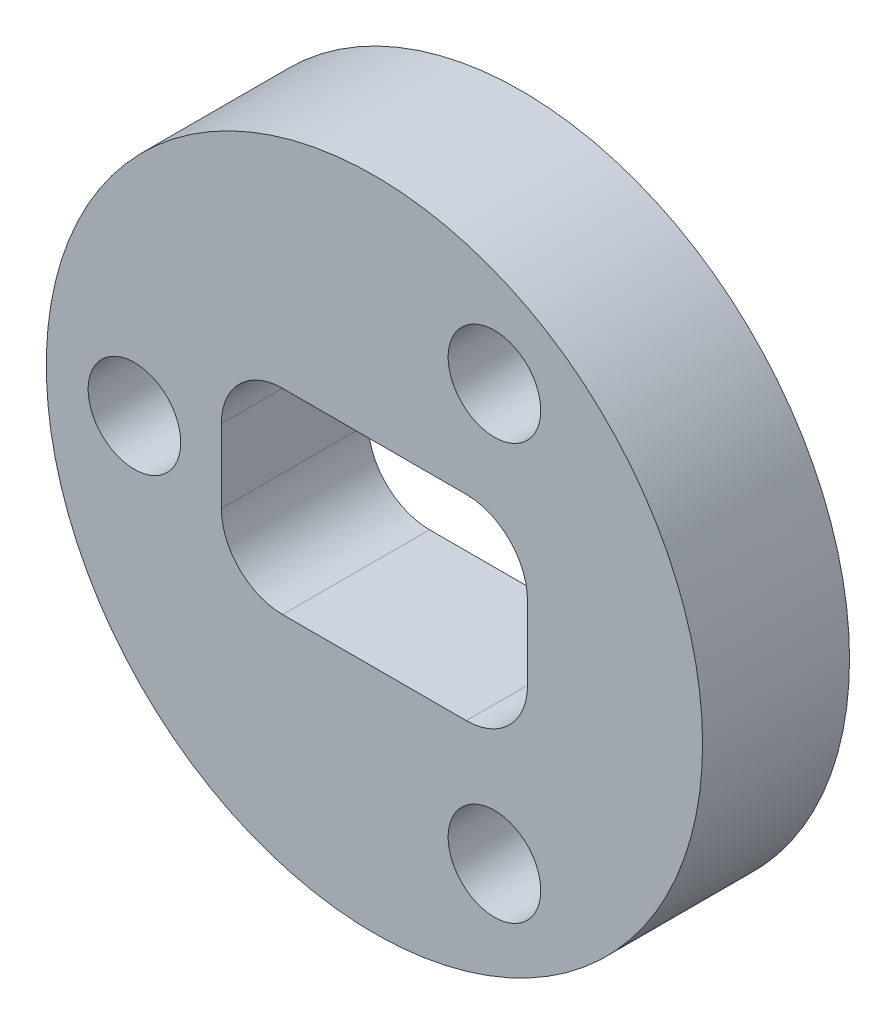
ISO-10303-21;
HEADER;
FILE_DESCRIPTION(('STEP AP214'),'2;1');
FILE_NAME('part.step','',(''),(''),'','','');
FILE_SCHEMA(('AUTOMOTIVE_DESIGN { 1 0 10303 214 1 1 1 1 }'));
ENDSEC;
DATA;
#1=APPLICATION_CONTEXT('core data for automotive mechanical design processes');
#2=APPLICATION_PROTOCOL_DEFINITION('international standard','automotive_design',2000,#1);
#3=PRODUCT_CONTEXT('',#1,'mechanical');
#4=PRODUCT('Part','Part','',(#3));
#5=PRODUCT_RELATED_PRODUCT_CATEGORY('part','',(#4));
#6=PRODUCT_DEFINITION_FORMATION('','',#4);
#7=PRODUCT_DEFINITION_CONTEXT('part definition',#1,'design');
#8=PRODUCT_DEFINITION('design','',#6,#7);
#9=PRODUCT_DEFINITION_SHAPE('','',#8);
#10=(LENGTH_UNIT() NAMED_UNIT(*) SI_UNIT(.MILLI.,.METRE.));
#11=(NAMED_UNIT(*) PLANE_ANGLE_UNIT() SI_UNIT($,.RADIAN.));
#12=(NAMED_UNIT(*) SI_UNIT($,.STERADIAN.) SOLID_ANGLE_UNIT());
#13=UNCERTAINTY_MEASURE_WITH_UNIT(LENGTH_MEASURE(1.E-05),#10,'distance_accuracy_value','');
#14=(GEOMETRIC_REPRESENTATION_CONTEXT(3) GLOBAL_UNCERTAINTY_ASSIGNED_CONTEXT((#13)) GLOBAL_UNIT_ASSIGNED_CONTEXT((#10,
#11,#12)) REPRESENTATION_CONTEXT('',''));
#15=CARTESIAN_POINT('',(0.,0.,0.));
#16=DIRECTION('',(0.,0.,1.));
#17=DIRECTION('',(1.,0.,0.));
#18=AXIS2_PLACEMENT_3D('',#15,#16,#17);
#19=CARTESIAN_POINT('',(0.,0.,3.81));
#20=DIRECTION('',(0.,0.,-1.));
#21=DIRECTION('',(-1.,0.,0.));
#22=AXIS2_PLACEMENT_3D('',#19,#20,#21);
#23=CYLINDRICAL_SURFACE('',#22,8.509);
#24=CARTESIAN_POINT('',(0.,0.,3.81));
#25=DIRECTION('',(0.,0.,1.));
#26=DIRECTION('',(1.,0.,0.));
#27=AXIS2_PLACEMENT_3D('',#24,#25,#26);
#28=CIRCLE('',#27,8.509);
#29=CARTESIAN_POINT('',(8.509,0.,3.81));
#30=VERTEX_POINT('',#29);
#31=EDGE_CURVE('E135',#30,#30,#28,.T.);
#32=ORIENTED_EDGE('',*,*,#31,.F.);
#33=EDGE_LOOP('',(#32));
#34=FACE_BOUND('',#33,.T.);
#35=CARTESIAN_POINT('',(0.,0.,0.));
#36=DIRECTION('',(0.,0.,1.));
#37=DIRECTION('',(1.,0.,0.));
#38=AXIS2_PLACEMENT_3D('',#35,#36,#37);
#39=CIRCLE('',#38,8.509);
#40=CARTESIAN_POINT('',(8.509,0.,0.));
#41=VERTEX_POINT('',#40);
#42=EDGE_CURVE('E138',#41,#41,#39,.T.);
#43=ORIENTED_EDGE('',*,*,#42,.T.);
#44=EDGE_LOOP('',(#43));
#45=FACE_BOUND('',#44,.T.);
#46=ADVANCED_FACE('F32',(#34,#45),#23,.T.);
#47=CARTESIAN_POINT('',(0.,0.,3.81));
#48=DIRECTION('',(0.,0.,1.));
#49=DIRECTION('',(1.,0.,0.));
#50=AXIS2_PLACEMENT_3D('',#47,#48,#49);
#51=PLANE('',#50);
#52=CARTESIAN_POINT('',(-6.223,0.,3.81));
#53=DIRECTION('',(0.,0.,1.));
#54=DIRECTION('',(1.,0.,0.));
#55=AXIS2_PLACEMENT_3D('',#52,#53,#54);
#56=CIRCLE('',#55,1.19999999999999);
#57=CARTESIAN_POINT('',(-5.02300000000001,0.,3.81));
#58=VERTEX_POINT('',#57);
#59=EDGE_CURVE('E200',#58,#58,#56,.T.);
#60=ORIENTED_EDGE('',*,*,#59,.F.);
#61=EDGE_LOOP('',(#60));
#62=FACE_BOUND('',#61,.T.);
#63=CARTESIAN_POINT('',(3.11150000000003,5.38927608775061,3.81));
#64=DIRECTION('',(0.,0.,1.));
#65=DIRECTION('',(1.,0.,0.));
#66=AXIS2_PLACEMENT_3D('',#63,#64,#65);
#67=CIRCLE('',#66,1.19999999999999);
#68=CARTESIAN_POINT('',(4.31150000000002,5.38927608775061,3.81));
#69=VERTEX_POINT('',#68);
#70=EDGE_CURVE('E192',#69,#69,#67,.T.);
#71=ORIENTED_EDGE('',*,*,#70,.F.);
#72=EDGE_LOOP('',(#71));
#73=FACE_BOUND('',#72,.T.);
#74=CARTESIAN_POINT('',(3.11150000000005,-5.38927608775056,3.81));
#75=DIRECTION('',(0.,0.,1.));
#76=DIRECTION('',(1.,0.,0.));
#77=AXIS2_PLACEMENT_3D('',#74,#75,#76);
#78=CIRCLE('',#77,1.19999999999999);
#79=CARTESIAN_POINT('',(4.31150000000004,-5.38927608775056,3.81));
#80=VERTEX_POINT('',#79);
#81=EDGE_CURVE('E184',#80,#80,#78,.T.);
#82=ORIENTED_EDGE('',*,*,#81,.F.);
#83=EDGE_LOOP('',(#82));
#84=FACE_BOUND('',#83,.T.);
#85=DIRECTION('',(0.,-1.,0.));
#86=VECTOR('',#85,1.);
#87=CARTESIAN_POINT('',(-3.96875,2.54,3.81));
#88=LINE('',#87,#86);
#89=CARTESIAN_POINT('',(-3.96875,0.9525,3.81));
#90=VERTEX_POINT('',#89);
#91=CARTESIAN_POINT('',(-3.96875,-0.952500000000001,3.81));
#92=VERTEX_POINT('',#91);
#93=EDGE_CURVE('E131',#90,#92,#88,.T.);
#94=ORIENTED_EDGE('',*,*,#93,.F.);
#95=CARTESIAN_POINT('',(-2.38125,0.9525,3.81));
#96=DIRECTION('',(0.,0.,1.));
#97=DIRECTION('',(1.,0.,0.));
#98=AXIS2_PLACEMENT_3D('',#95,#96,#97);
#99=CIRCLE('',#98,1.5875);
#100=CARTESIAN_POINT('',(-2.38125,2.54,3.81));
#101=VERTEX_POINT('',#100);
#102=EDGE_CURVE('E40',#90,#101,#99,.F.);
#103=ORIENTED_EDGE('',*,*,#102,.T.);
#104=DIRECTION('',(-1.,0.,0.));
#105=VECTOR('',#104,1.);
#106=CARTESIAN_POINT('',(-3.96875,2.54,3.81));
#107=LINE('',#106,#105);
#108=CARTESIAN_POINT('',(2.38125,2.54,3.81));
#109=VERTEX_POINT('',#108);
#110=EDGE_CURVE('E126',#109,#101,#107,.T.);
#111=ORIENTED_EDGE('',*,*,#110,.F.);
#112=CARTESIAN_POINT('',(2.38125,0.9525,3.81));
#113=DIRECTION('',(0.,0.,1.));
#114=DIRECTION('',(1.,0.,0.));
#115=AXIS2_PLACEMENT_3D('',#112,#113,#114);
#116=CIRCLE('',#115,1.5875);
#117=CARTESIAN_POINT('',(3.96875,0.9525,3.81));
#118=VERTEX_POINT('',#117);
#119=EDGE_CURVE('E125',#109,#118,#116,.F.);
#120=ORIENTED_EDGE('',*,*,#119,.T.);
#121=DIRECTION('',(0.,1.,0.));
#122=VECTOR('',#121,1.);
#123=CARTESIAN_POINT('',(3.96875,2.54,3.81));
#124=LINE('',#123,#122);
#125=CARTESIAN_POINT('',(3.96875,-0.952500000000002,3.81));
#126=VERTEX_POINT('',#125);
#127=EDGE_CURVE('E115',#126,#118,#124,.T.);
#128=ORIENTED_EDGE('',*,*,#127,.F.);
#129=CARTESIAN_POINT('',(2.38125,-0.952500000000001,3.81));
#130=DIRECTION('',(0.,0.,1.));
#131=DIRECTION('',(1.,0.,0.));
#132=AXIS2_PLACEMENT_3D('',#129,#130,#131);
#133=CIRCLE('',#132,1.5875);
#134=CARTESIAN_POINT('',(2.38125,-2.54,3.81));
#135=VERTEX_POINT('',#134);
#136=EDGE_CURVE('E98',#126,#135,#133,.F.);
#137=ORIENTED_EDGE('',*,*,#136,.T.);
#138=DIRECTION('',(1.,0.,0.));
#139=VECTOR('',#138,1.);
#140=CARTESIAN_POINT('',(-3.96875,-2.54,3.81));
#141=LINE('',#140,#139);
#142=CARTESIAN_POINT('',(-2.38125,-2.54,3.81));
#143=VERTEX_POINT('',#142);
#144=EDGE_CURVE('E127',#143,#135,#141,.T.);
#145=ORIENTED_EDGE('',*,*,#144,.F.);
#146=CARTESIAN_POINT('',(-2.38125,-0.952500000000001,3.81));
#147=DIRECTION('',(0.,0.,1.));
#148=DIRECTION('',(1.,0.,0.));
#149=AXIS2_PLACEMENT_3D('',#146,#147,#148);
#150=CIRCLE('',#149,1.5875);
#151=EDGE_CURVE('E155',#143,#92,#150,.F.);
#152=ORIENTED_EDGE('',*,*,#151,.T.);
#153=EDGE_LOOP('',(#94,#103,#111,#120,#128,#137,#145,#152));
#154=FACE_BOUND('',#153,.T.);
#155=ORIENTED_EDGE('',*,*,#31,.T.);
#156=EDGE_LOOP('',(#155));
#157=FACE_BOUND('',#156,.T.);
#158=ADVANCED_FACE('F122',(#62,#73,#84,#154,#157),#51,.T.);
#159=CARTESIAN_POINT('',(0.,0.,0.));
#160=DIRECTION('',(0.,0.,1.));
#161=DIRECTION('',(1.,0.,0.));
#162=AXIS2_PLACEMENT_3D('',#159,#160,#161);
#163=PLANE('',#162);
#164=CARTESIAN_POINT('',(-6.223,0.,0.));
#165=DIRECTION('',(0.,0.,1.));
#166=DIRECTION('',(1.,0.,0.));
#167=AXIS2_PLACEMENT_3D('',#164,#165,#166);
#168=CIRCLE('',#167,1.2);
#169=CARTESIAN_POINT('',(-5.023,0.,0.));
#170=VERTEX_POINT('',#169);
#171=EDGE_CURVE('E197',#170,#170,#168,.T.);
#172=ORIENTED_EDGE('',*,*,#171,.T.);
#173=EDGE_LOOP('',(#172));
#174=FACE_BOUND('',#173,.T.);
#175=CARTESIAN_POINT('',(3.11150000000003,5.38927608775061,0.));
#176=DIRECTION('',(0.,0.,1.));
#177=DIRECTION('',(1.,0.,0.));
#178=AXIS2_PLACEMENT_3D('',#175,#176,#177);
#179=CIRCLE('',#178,1.2);
#180=CARTESIAN_POINT('',(4.31150000000003,5.38927608775061,0.));
#181=VERTEX_POINT('',#180);
#182=EDGE_CURVE('E188',#181,#181,#179,.T.);
#183=ORIENTED_EDGE('',*,*,#182,.T.);
#184=EDGE_LOOP('',(#183));
#185=FACE_BOUND('',#184,.T.);
#186=CARTESIAN_POINT('',(3.11150000000005,-5.38927608775056,0.));
#187=DIRECTION('',(0.,0.,1.));
#188=DIRECTION('',(1.,0.,0.));
#189=AXIS2_PLACEMENT_3D('',#186,#187,#188);
#190=CIRCLE('',#189,1.2);
#191=CARTESIAN_POINT('',(4.31150000000005,-5.38927608775056,0.));
#192=VERTEX_POINT('',#191);
#193=EDGE_CURVE('E179',#192,#192,#190,.T.);
#194=ORIENTED_EDGE('',*,*,#193,.T.);
#195=EDGE_LOOP('',(#194));
#196=FACE_BOUND('',#195,.T.);
#197=DIRECTION('',(0.,1.,0.));
#198=VECTOR('',#197,1.);
#199=CARTESIAN_POINT('',(3.96875,2.54,0.));
#200=LINE('',#199,#198);
#201=CARTESIAN_POINT('',(3.96875,-0.952500000000002,0.));
#202=VERTEX_POINT('',#201);
#203=CARTESIAN_POINT('',(3.96875,0.9525,0.));
#204=VERTEX_POINT('',#203);
#205=EDGE_CURVE('E117',#202,#204,#200,.T.);
#206=ORIENTED_EDGE('',*,*,#205,.T.);
#207=CARTESIAN_POINT('',(2.38125,0.9525,0.));
#208=DIRECTION('',(0.,0.,1.));
#209=DIRECTION('',(1.,0.,0.));
#210=AXIS2_PLACEMENT_3D('',#207,#208,#209);
#211=CIRCLE('',#210,1.5875);
#212=CARTESIAN_POINT('',(2.38125,2.54,0.));
#213=VERTEX_POINT('',#212);
#214=EDGE_CURVE('E54',#204,#213,#211,.T.);
#215=ORIENTED_EDGE('',*,*,#214,.T.);
#216=DIRECTION('',(-1.,0.,0.));
#217=VECTOR('',#216,1.);
#218=CARTESIAN_POINT('',(-3.96875,2.54,0.));
#219=LINE('',#218,#217);
#220=CARTESIAN_POINT('',(-2.38125,2.54,0.));
#221=VERTEX_POINT('',#220);
#222=EDGE_CURVE('E141',#213,#221,#219,.T.);
#223=ORIENTED_EDGE('',*,*,#222,.T.);
#224=CARTESIAN_POINT('',(-2.38125,0.9525,0.));
#225=DIRECTION('',(0.,0.,1.));
#226=DIRECTION('',(1.,0.,0.));
#227=AXIS2_PLACEMENT_3D('',#224,#225,#226);
#228=CIRCLE('',#227,1.5875);
#229=CARTESIAN_POINT('',(-3.96875,0.9525,0.));
#230=VERTEX_POINT('',#229);
#231=EDGE_CURVE('E11',#221,#230,#228,.T.);
#232=ORIENTED_EDGE('',*,*,#231,.T.);
#233=DIRECTION('',(0.,-1.,0.));
#234=VECTOR('',#233,1.);
#235=CARTESIAN_POINT('',(-3.96875,2.54,0.));
#236=LINE('',#235,#234);
#237=CARTESIAN_POINT('',(-3.96875,-0.952500000000001,0.));
#238=VERTEX_POINT('',#237);
#239=EDGE_CURVE('E129',#230,#238,#236,.T.);
#240=ORIENTED_EDGE('',*,*,#239,.T.);
#241=CARTESIAN_POINT('',(-2.38125,-0.952500000000001,0.));
#242=DIRECTION('',(0.,0.,1.));
#243=DIRECTION('',(1.,0.,0.));
#244=AXIS2_PLACEMENT_3D('',#241,#242,#243);
#245=CIRCLE('',#244,1.5875);
#246=CARTESIAN_POINT('',(-2.38125,-2.54,0.));
#247=VERTEX_POINT('',#246);
#248=EDGE_CURVE('E157',#238,#247,#245,.T.);
#249=ORIENTED_EDGE('',*,*,#248,.T.);
#250=DIRECTION('',(1.,0.,0.));
#251=VECTOR('',#250,1.);
#252=CARTESIAN_POINT('',(-3.96875,-2.54,0.));
#253=LINE('',#252,#251);
#254=CARTESIAN_POINT('',(2.38125,-2.54,0.));
#255=VERTEX_POINT('',#254);
#256=EDGE_CURVE('E174',#247,#255,#253,.T.);
#257=ORIENTED_EDGE('',*,*,#256,.T.);
#258=CARTESIAN_POINT('',(2.38125,-0.952500000000001,0.));
#259=DIRECTION('',(0.,0.,1.));
#260=DIRECTION('',(1.,0.,0.));
#261=AXIS2_PLACEMENT_3D('',#258,#259,#260);
#262=CIRCLE('',#261,1.5875);
#263=EDGE_CURVE('E108',#255,#202,#262,.T.);
#264=ORIENTED_EDGE('',*,*,#263,.T.);
#265=EDGE_LOOP('',(#206,#215,#223,#232,#240,#249,#257,#264));
#266=FACE_BOUND('',#265,.T.);
#267=ORIENTED_EDGE('',*,*,#42,.F.);
#268=EDGE_LOOP('',(#267));
#269=FACE_BOUND('',#268,.T.);
#270=ADVANCED_FACE('F168',(#174,#185,#196,#266,#269),#163,.F.);
#271=CARTESIAN_POINT('',(-3.96875,2.54,0.));
#272=DIRECTION('',(-1.,0.,0.));
#273=DIRECTION('',(0.,-1.,0.));
#274=AXIS2_PLACEMENT_3D('',#271,#272,#273);
#275=PLANE('',#274);
#276=ORIENTED_EDGE('',*,*,#93,.T.);
#277=DIRECTION('',(0.,0.,1.));
#278=VECTOR('',#277,1.);
#279=CARTESIAN_POINT('',(-3.96875,-0.952500000000001,0.));
#280=LINE('',#279,#278);
#281=EDGE_CURVE('E149',#92,#238,#280,.F.);
#282=ORIENTED_EDGE('',*,*,#281,.T.);
#283=ORIENTED_EDGE('',*,*,#239,.F.);
#284=DIRECTION('',(0.,0.,1.));
#285=VECTOR('',#284,1.);
#286=CARTESIAN_POINT('',(-3.96875,0.9525,3.81));
#287=LINE('',#286,#285);
#288=EDGE_CURVE('E146',#230,#90,#287,.T.);
#289=ORIENTED_EDGE('',*,*,#288,.T.);
#290=EDGE_LOOP('',(#276,#282,#283,#289));
#291=FACE_BOUND('',#290,.T.);
#292=ADVANCED_FACE('F172',(#291),#275,.F.);
#293=CARTESIAN_POINT('',(-3.96875,2.54,0.));
#294=DIRECTION('',(0.,1.,0.));
#295=DIRECTION('',(0.,0.,1.));
#296=AXIS2_PLACEMENT_3D('',#293,#294,#295);
#297=PLANE('',#296);
#298=ORIENTED_EDGE('',*,*,#222,.F.);
#299=DIRECTION('',(0.,0.,1.));
#300=VECTOR('',#299,1.);
#301=CARTESIAN_POINT('',(2.38125,2.54,3.81));
#302=LINE('',#301,#300);
#303=EDGE_CURVE('E109',#213,#109,#302,.T.);
#304=ORIENTED_EDGE('',*,*,#303,.T.);
#305=ORIENTED_EDGE('',*,*,#110,.T.);
#306=DIRECTION('',(0.,0.,1.));
#307=VECTOR('',#306,1.);
#308=CARTESIAN_POINT('',(-2.38125,2.54,0.));
#309=LINE('',#308,#307);
#310=EDGE_CURVE('E47',#101,#221,#309,.F.);
#311=ORIENTED_EDGE('',*,*,#310,.T.);
#312=EDGE_LOOP('',(#298,#304,#305,#311));
#313=FACE_BOUND('',#312,.T.);
#314=ADVANCED_FACE('F163',(#313),#297,.F.);
#315=CARTESIAN_POINT('',(3.96875,2.54,0.));
#316=DIRECTION('',(1.,0.,0.));
#317=DIRECTION('',(0.,1.,0.));
#318=AXIS2_PLACEMENT_3D('',#315,#316,#317);
#319=PLANE('',#318);
#320=ORIENTED_EDGE('',*,*,#205,.F.);
#321=DIRECTION('',(0.,0.,1.));
#322=VECTOR('',#321,1.);
#323=CARTESIAN_POINT('',(3.96875,-0.952500000000001,3.81));
#324=LINE('',#323,#322);
#325=EDGE_CURVE('E102',#202,#126,#324,.T.);
#326=ORIENTED_EDGE('',*,*,#325,.T.);
#327=ORIENTED_EDGE('',*,*,#127,.T.);
#328=DIRECTION('',(0.,0.,1.));
#329=VECTOR('',#328,1.);
#330=CARTESIAN_POINT('',(3.96875,0.9525,0.));
#331=LINE('',#330,#329);
#332=EDGE_CURVE('E119',#118,#204,#331,.F.);
#333=ORIENTED_EDGE('',*,*,#332,.T.);
#334=EDGE_LOOP('',(#320,#326,#327,#333));
#335=FACE_BOUND('',#334,.T.);
#336=ADVANCED_FACE('F114',(#335),#319,.F.);
#337=CARTESIAN_POINT('',(-3.96875,-2.54,0.));
#338=DIRECTION('',(0.,-1.,0.));
#339=DIRECTION('',(0.,0.,-1.));
#340=AXIS2_PLACEMENT_3D('',#337,#338,#339);
#341=PLANE('',#340);
#342=ORIENTED_EDGE('',*,*,#144,.T.);
#343=DIRECTION('',(0.,0.,1.));
#344=VECTOR('',#343,1.);
#345=CARTESIAN_POINT('',(2.38125,-2.54,0.));
#346=LINE('',#345,#344);
#347=EDGE_CURVE('E103',#135,#255,#346,.F.);
#348=ORIENTED_EDGE('',*,*,#347,.T.);
#349=ORIENTED_EDGE('',*,*,#256,.F.);
#350=DIRECTION('',(0.,0.,1.));
#351=VECTOR('',#350,1.);
#352=CARTESIAN_POINT('',(-2.38125,-2.54,3.81));
#353=LINE('',#352,#351);
#354=EDGE_CURVE('E118',#247,#143,#353,.T.);
#355=ORIENTED_EDGE('',*,*,#354,.T.);
#356=EDGE_LOOP('',(#342,#348,#349,#355));
#357=FACE_BOUND('',#356,.T.);
#358=ADVANCED_FACE('F223',(#357),#341,.F.);
#359=CARTESIAN_POINT('',(3.11150000000005,-5.38927608775056,3.81));
#360=DIRECTION('',(0.,0.,1.));
#361=DIRECTION('',(1.,0.,0.));
#362=AXIS2_PLACEMENT_3D('',#359,#360,#361);
#363=CYLINDRICAL_SURFACE('',#362,1.19999999999999);
#364=ORIENTED_EDGE('',*,*,#193,.F.);
#365=EDGE_LOOP('',(#364));
#366=FACE_BOUND('',#365,.T.);
#367=ORIENTED_EDGE('',*,*,#81,.T.);
#368=EDGE_LOOP('',(#367));
#369=FACE_BOUND('',#368,.T.);
#370=ADVANCED_FACE('F214',(#366,#369),#363,.F.);
#371=CARTESIAN_POINT('',(3.11150000000003,5.38927608775061,3.81));
#372=DIRECTION('',(0.,0.,1.));
#373=DIRECTION('',(1.,0.,0.));
#374=AXIS2_PLACEMENT_3D('',#371,#372,#373);
#375=CYLINDRICAL_SURFACE('',#374,1.19999999999999);
#376=ORIENTED_EDGE('',*,*,#182,.F.);
#377=EDGE_LOOP('',(#376));
#378=FACE_BOUND('',#377,.T.);
#379=ORIENTED_EDGE('',*,*,#70,.T.);
#380=EDGE_LOOP('',(#379));
#381=FACE_BOUND('',#380,.T.);
#382=ADVANCED_FACE('F212',(#378,#381),#375,.F.);
#383=CARTESIAN_POINT('',(-6.223,0.,3.81));
#384=DIRECTION('',(0.,0.,1.));
#385=DIRECTION('',(1.,0.,0.));
#386=AXIS2_PLACEMENT_3D('',#383,#384,#385);
#387=CYLINDRICAL_SURFACE('',#386,1.19999999999999);
#388=ORIENTED_EDGE('',*,*,#171,.F.);
#389=EDGE_LOOP('',(#388));
#390=FACE_BOUND('',#389,.T.);
#391=ORIENTED_EDGE('',*,*,#59,.T.);
#392=EDGE_LOOP('',(#391));
#393=FACE_BOUND('',#392,.T.);
#394=ADVANCED_FACE('F204',(#390,#393),#387,.F.);
#395=CARTESIAN_POINT('',(2.38125,-0.952500000000001,0.));
#396=DIRECTION('',(0.,0.,-1.));
#397=DIRECTION('',(-1.,0.,0.));
#398=AXIS2_PLACEMENT_3D('',#395,#396,#397);
#399=CYLINDRICAL_SURFACE('',#398,1.5875);
#400=ORIENTED_EDGE('',*,*,#263,.F.);
#401=ORIENTED_EDGE('',*,*,#347,.F.);
#402=ORIENTED_EDGE('',*,*,#136,.F.);
#403=ORIENTED_EDGE('',*,*,#325,.F.);
#404=EDGE_LOOP('',(#400,#401,#402,#403));
#405=FACE_BOUND('',#404,.T.);
#406=ADVANCED_FACE('F101',(#405),#399,.F.);
#407=CARTESIAN_POINT('',(-2.38125,-0.952500000000001,0.));
#408=DIRECTION('',(0.,0.,-1.));
#409=DIRECTION('',(-1.,0.,0.));
#410=AXIS2_PLACEMENT_3D('',#407,#408,#409);
#411=CYLINDRICAL_SURFACE('',#410,1.5875);
#412=ORIENTED_EDGE('',*,*,#248,.F.);
#413=ORIENTED_EDGE('',*,*,#281,.F.);
#414=ORIENTED_EDGE('',*,*,#151,.F.);
#415=ORIENTED_EDGE('',*,*,#354,.F.);
#416=EDGE_LOOP('',(#412,#413,#414,#415));
#417=FACE_BOUND('',#416,.T.);
#418=ADVANCED_FACE('F238',(#417),#411,.F.);
#419=CARTESIAN_POINT('',(2.38125,0.9525,0.));
#420=DIRECTION('',(0.,0.,-1.));
#421=DIRECTION('',(-1.,0.,0.));
#422=AXIS2_PLACEMENT_3D('',#419,#420,#421);
#423=CYLINDRICAL_SURFACE('',#422,1.5875);
#424=ORIENTED_EDGE('',*,*,#214,.F.);
#425=ORIENTED_EDGE('',*,*,#332,.F.);
#426=ORIENTED_EDGE('',*,*,#119,.F.);
#427=ORIENTED_EDGE('',*,*,#303,.F.);
#428=EDGE_LOOP('',(#424,#425,#426,#427));
#429=FACE_BOUND('',#428,.T.);
#430=ADVANCED_FACE('F240',(#429),#423,.F.);
#431=CARTESIAN_POINT('',(-2.38125,0.9525,0.));
#432=DIRECTION('',(0.,0.,-1.));
#433=DIRECTION('',(-1.,0.,0.));
#434=AXIS2_PLACEMENT_3D('',#431,#432,#433);
#435=CYLINDRICAL_SURFACE('',#434,1.5875);
#436=ORIENTED_EDGE('',*,*,#231,.F.);
#437=ORIENTED_EDGE('',*,*,#310,.F.);
#438=ORIENTED_EDGE('',*,*,#102,.F.);
#439=ORIENTED_EDGE('',*,*,#288,.F.);
#440=EDGE_LOOP('',(#436,#437,#438,#439));
#441=FACE_BOUND('',#440,.T.);
#442=ADVANCED_FACE('F34',(#441),#435,.F.);
#443=CLOSED_SHELL('',(#46,#158,#270,#292,#314,#336,#358,#370,#382,#394,#406,#418,#430,#442));
#444=MANIFOLD_SOLID_BREP('B2',#443);
#445=ADVANCED_BREP_SHAPE_REPRESENTATION('',(#18,#444),#14);
#446=SHAPE_DEFINITION_REPRESENTATION(#9,#445);
ENDSEC;
END-ISO-10303-21;
